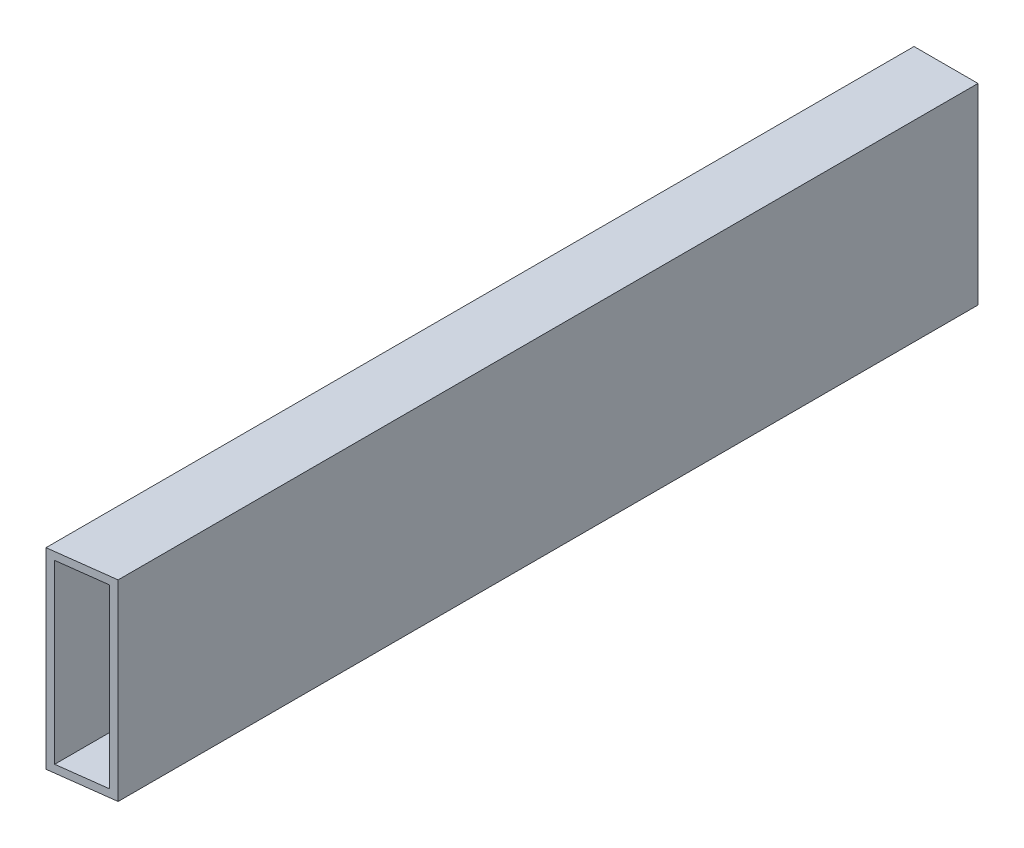
ISO-10303-21;
HEADER;
FILE_DESCRIPTION(('STEP AP214'),'2;1');
FILE_NAME('part.step','',(''),(''),'','','');
FILE_SCHEMA(('AUTOMOTIVE_DESIGN { 1 0 10303 214 1 1 1 1 }'));
ENDSEC;
DATA;
#1=APPLICATION_CONTEXT('core data for automotive mechanical design processes');
#2=APPLICATION_PROTOCOL_DEFINITION('international standard','automotive_design',2000,#1);
#3=PRODUCT_CONTEXT('',#1,'mechanical');
#4=PRODUCT('Part','Part','',(#3));
#5=PRODUCT_RELATED_PRODUCT_CATEGORY('part','',(#4));
#6=PRODUCT_DEFINITION_FORMATION('','',#4);
#7=PRODUCT_DEFINITION_CONTEXT('part definition',#1,'design');
#8=PRODUCT_DEFINITION('design','',#6,#7);
#9=PRODUCT_DEFINITION_SHAPE('','',#8);
#10=(LENGTH_UNIT() NAMED_UNIT(*) SI_UNIT(.MILLI.,.METRE.));
#11=(NAMED_UNIT(*) PLANE_ANGLE_UNIT() SI_UNIT($,.RADIAN.));
#12=(NAMED_UNIT(*) SI_UNIT($,.STERADIAN.) SOLID_ANGLE_UNIT());
#13=UNCERTAINTY_MEASURE_WITH_UNIT(LENGTH_MEASURE(1.E-05),#10,'distance_accuracy_value','');
#14=(GEOMETRIC_REPRESENTATION_CONTEXT(3) GLOBAL_UNCERTAINTY_ASSIGNED_CONTEXT((#13)) GLOBAL_UNIT_ASSIGNED_CONTEXT((#10,
#11,#12)) REPRESENTATION_CONTEXT('',''));
#15=CARTESIAN_POINT('',(0.,0.,0.));
#16=DIRECTION('',(0.,0.,1.));
#17=DIRECTION('',(1.,0.,0.));
#18=AXIS2_PLACEMENT_3D('',#15,#16,#17);
#19=CARTESIAN_POINT('',(12.7000000000001,0.,343.));
#20=DIRECTION('',(-1.,0.,0.));
#21=DIRECTION('',(0.,-1.,0.));
#22=AXIS2_PLACEMENT_3D('',#19,#20,#21);
#23=PLANE('',#22);
#24=DIRECTION('',(0.,0.,-1.));
#25=VECTOR('',#24,1.);
#26=CARTESIAN_POINT('',(12.7,38.1,343.));
#27=LINE('',#26,#25);
#28=CARTESIAN_POINT('',(12.7,38.1,341.382355489375));
#29=VERTEX_POINT('',#28);
#30=CARTESIAN_POINT('',(12.7,38.1,0.));
#31=VERTEX_POINT('',#30);
#32=EDGE_CURVE('E11',#29,#31,#27,.T.);
#33=ORIENTED_EDGE('',*,*,#32,.F.);
#34=DIRECTION('',(0.,-1.,0.));
#35=VECTOR('',#34,1.);
#36=CARTESIAN_POINT('',(12.7000000000001,0.,341.382355489375));
#37=LINE('',#36,#35);
#38=CARTESIAN_POINT('',(12.7,-38.1,341.382355489375));
#39=VERTEX_POINT('',#38);
#40=EDGE_CURVE('E100',#29,#39,#37,.T.);
#41=ORIENTED_EDGE('',*,*,#40,.T.);
#42=DIRECTION('',(0.,0.,-1.));
#43=VECTOR('',#42,1.);
#44=CARTESIAN_POINT('',(12.7,-38.1,343.));
#45=LINE('',#44,#43);
#46=CARTESIAN_POINT('',(12.7,-38.1,0.));
#47=VERTEX_POINT('',#46);
#48=EDGE_CURVE('E110',#39,#47,#45,.T.);
#49=ORIENTED_EDGE('',*,*,#48,.T.);
#50=DIRECTION('',(0.,1.,0.));
#51=VECTOR('',#50,1.);
#52=CARTESIAN_POINT('',(12.7000000000001,0.,0.));
#53=LINE('',#52,#51);
#54=EDGE_CURVE('E154',#47,#31,#53,.T.);
#55=ORIENTED_EDGE('',*,*,#54,.T.);
#56=EDGE_LOOP('',(#33,#41,#49,#55));
#57=FACE_BOUND('',#56,.T.);
#58=ADVANCED_FACE('F34',(#57),#23,.F.);
#59=CARTESIAN_POINT('',(0.,38.1,343.));
#60=DIRECTION('',(0.,1.,0.));
#61=DIRECTION('',(0.,0.,1.));
#62=AXIS2_PLACEMENT_3D('',#59,#60,#61);
#63=PLANE('',#62);
#64=DIRECTION('',(-0.991985376438617,0.,0.126352732190229));
#65=VECTOR('',#64,1.);
#66=CARTESIAN_POINT('',(0.,38.1,343.));
#67=LINE('',#66,#65);
#68=CARTESIAN_POINT('',(-12.7,38.1,344.617644510625));
#69=VERTEX_POINT('',#68);
#70=EDGE_CURVE('E113',#29,#69,#67,.T.);
#71=ORIENTED_EDGE('',*,*,#70,.F.);
#72=ORIENTED_EDGE('',*,*,#32,.T.);
#73=DIRECTION('',(1.,0.,0.));
#74=VECTOR('',#73,1.);
#75=CARTESIAN_POINT('',(0.,38.1,0.));
#76=LINE('',#75,#74);
#77=CARTESIAN_POINT('',(-12.7,38.1,0.));
#78=VERTEX_POINT('',#77);
#79=EDGE_CURVE('E159',#78,#31,#76,.T.);
#80=ORIENTED_EDGE('',*,*,#79,.F.);
#81=DIRECTION('',(0.,0.,-1.));
#82=VECTOR('',#81,1.);
#83=CARTESIAN_POINT('',(-12.7,38.1,343.));
#84=LINE('',#83,#82);
#85=EDGE_CURVE('E43',#69,#78,#84,.T.);
#86=ORIENTED_EDGE('',*,*,#85,.F.);
#87=EDGE_LOOP('',(#71,#72,#80,#86));
#88=FACE_BOUND('',#87,.T.);
#89=ADVANCED_FACE('F167',(#88),#63,.T.);
#90=CARTESIAN_POINT('',(-12.7,0.,343.));
#91=DIRECTION('',(-1.,0.,0.));
#92=DIRECTION('',(0.,0.,1.));
#93=AXIS2_PLACEMENT_3D('',#90,#91,#92);
#94=PLANE('',#93);
#95=DIRECTION('',(0.,-1.,0.));
#96=VECTOR('',#95,1.);
#97=CARTESIAN_POINT('',(-12.7,0.,344.617644510625));
#98=LINE('',#97,#96);
#99=CARTESIAN_POINT('',(-12.7,-38.1,344.617644510625));
#100=VERTEX_POINT('',#99);
#101=EDGE_CURVE('E59',#69,#100,#98,.T.);
#102=ORIENTED_EDGE('',*,*,#101,.F.);
#103=ORIENTED_EDGE('',*,*,#85,.T.);
#104=DIRECTION('',(0.,1.,0.));
#105=VECTOR('',#104,1.);
#106=CARTESIAN_POINT('',(-12.7,0.,0.));
#107=LINE('',#106,#105);
#108=CARTESIAN_POINT('',(-12.7,-38.1,0.));
#109=VERTEX_POINT('',#108);
#110=EDGE_CURVE('E161',#109,#78,#107,.T.);
#111=ORIENTED_EDGE('',*,*,#110,.F.);
#112=DIRECTION('',(0.,0.,-1.));
#113=VECTOR('',#112,1.);
#114=CARTESIAN_POINT('',(-12.7,-38.1,343.));
#115=LINE('',#114,#113);
#116=EDGE_CURVE('E119',#100,#109,#115,.T.);
#117=ORIENTED_EDGE('',*,*,#116,.F.);
#118=EDGE_LOOP('',(#102,#103,#111,#117));
#119=FACE_BOUND('',#118,.T.);
#120=ADVANCED_FACE('F192',(#119),#94,.T.);
#121=CARTESIAN_POINT('',(9.652,0.,343.));
#122=DIRECTION('',(1.,0.,0.));
#123=DIRECTION('',(0.,1.,0.));
#124=AXIS2_PLACEMENT_3D('',#121,#122,#123);
#125=PLANE('',#124);
#126=DIRECTION('',(0.,0.,-1.));
#127=VECTOR('',#126,1.);
#128=CARTESIAN_POINT('',(9.652,-35.052,343.));
#129=LINE('',#128,#127);
#130=CARTESIAN_POINT('',(9.652,-35.052,341.770590171925));
#131=VERTEX_POINT('',#130);
#132=CARTESIAN_POINT('',(9.652,-35.052,0.));
#133=VERTEX_POINT('',#132);
#134=EDGE_CURVE('E38',#131,#133,#129,.T.);
#135=ORIENTED_EDGE('',*,*,#134,.F.);
#136=DIRECTION('',(0.,1.,0.));
#137=VECTOR('',#136,1.);
#138=CARTESIAN_POINT('',(9.652,0.,341.770590171925));
#139=LINE('',#138,#137);
#140=CARTESIAN_POINT('',(9.652,35.052,341.770590171925));
#141=VERTEX_POINT('',#140);
#142=EDGE_CURVE('E169',#131,#141,#139,.T.);
#143=ORIENTED_EDGE('',*,*,#142,.T.);
#144=DIRECTION('',(0.,0.,-1.));
#145=VECTOR('',#144,1.);
#146=CARTESIAN_POINT('',(9.65199999999999,35.052,343.));
#147=LINE('',#146,#145);
#148=CARTESIAN_POINT('',(9.65199999999999,35.052,0.));
#149=VERTEX_POINT('',#148);
#150=EDGE_CURVE('E127',#141,#149,#147,.T.);
#151=ORIENTED_EDGE('',*,*,#150,.T.);
#152=DIRECTION('',(0.,-1.,0.));
#153=VECTOR('',#152,1.);
#154=CARTESIAN_POINT('',(9.652,0.,0.));
#155=LINE('',#154,#153);
#156=EDGE_CURVE('E112',#149,#133,#155,.T.);
#157=ORIENTED_EDGE('',*,*,#156,.T.);
#158=EDGE_LOOP('',(#135,#143,#151,#157));
#159=FACE_BOUND('',#158,.T.);
#160=ADVANCED_FACE('F36',(#159),#125,.F.);
#161=CARTESIAN_POINT('',(0.,-35.052,343.));
#162=DIRECTION('',(0.,1.,0.));
#163=DIRECTION('',(-1.,0.,0.));
#164=AXIS2_PLACEMENT_3D('',#161,#162,#163);
#165=PLANE('',#164);
#166=DIRECTION('',(-0.991985376438617,0.,0.126352732190229));
#167=VECTOR('',#166,1.);
#168=CARTESIAN_POINT('',(0.,-35.052,343.));
#169=LINE('',#168,#167);
#170=CARTESIAN_POINT('',(-9.65199999999999,-35.052,344.229409828075));
#171=VERTEX_POINT('',#170);
#172=EDGE_CURVE('E178',#131,#171,#169,.T.);
#173=ORIENTED_EDGE('',*,*,#172,.F.);
#174=ORIENTED_EDGE('',*,*,#134,.T.);
#175=DIRECTION('',(1.,0.,0.));
#176=VECTOR('',#175,1.);
#177=CARTESIAN_POINT('',(0.,-35.052,0.));
#178=LINE('',#177,#176);
#179=CARTESIAN_POINT('',(-9.65199999999999,-35.052,0.));
#180=VERTEX_POINT('',#179);
#181=EDGE_CURVE('E141',#180,#133,#178,.T.);
#182=ORIENTED_EDGE('',*,*,#181,.F.);
#183=DIRECTION('',(0.,0.,-1.));
#184=VECTOR('',#183,1.);
#185=CARTESIAN_POINT('',(-9.65199999999999,-35.052,343.));
#186=LINE('',#185,#184);
#187=EDGE_CURVE('E122',#171,#180,#186,.T.);
#188=ORIENTED_EDGE('',*,*,#187,.F.);
#189=EDGE_LOOP('',(#173,#174,#182,#188));
#190=FACE_BOUND('',#189,.T.);
#191=ADVANCED_FACE('F142',(#190),#165,.T.);
#192=CARTESIAN_POINT('',(-9.65199999999999,0.,343.));
#193=DIRECTION('',(1.,0.,0.));
#194=DIRECTION('',(0.,1.,0.));
#195=AXIS2_PLACEMENT_3D('',#192,#193,#194);
#196=PLANE('',#195);
#197=DIRECTION('',(0.,1.,0.));
#198=VECTOR('',#197,1.);
#199=CARTESIAN_POINT('',(-9.65199999999999,0.,344.229409828075));
#200=LINE('',#199,#198);
#201=CARTESIAN_POINT('',(-9.652,35.052,344.229409828075));
#202=VERTEX_POINT('',#201);
#203=EDGE_CURVE('E51',#171,#202,#200,.T.);
#204=ORIENTED_EDGE('',*,*,#203,.F.);
#205=ORIENTED_EDGE('',*,*,#187,.T.);
#206=DIRECTION('',(0.,-1.,0.));
#207=VECTOR('',#206,1.);
#208=CARTESIAN_POINT('',(-9.65199999999999,0.,0.));
#209=LINE('',#208,#207);
#210=CARTESIAN_POINT('',(-9.65199999999999,35.052,0.));
#211=VERTEX_POINT('',#210);
#212=EDGE_CURVE('E137',#211,#180,#209,.T.);
#213=ORIENTED_EDGE('',*,*,#212,.F.);
#214=DIRECTION('',(0.,0.,-1.));
#215=VECTOR('',#214,1.);
#216=CARTESIAN_POINT('',(-9.65199999999999,35.052,343.));
#217=LINE('',#216,#215);
#218=EDGE_CURVE('E129',#202,#211,#217,.T.);
#219=ORIENTED_EDGE('',*,*,#218,.F.);
#220=EDGE_LOOP('',(#204,#205,#213,#219));
#221=FACE_BOUND('',#220,.T.);
#222=ADVANCED_FACE('F134',(#221),#196,.T.);
#223=CARTESIAN_POINT('',(0.,35.052,343.));
#224=DIRECTION('',(0.,1.,0.));
#225=DIRECTION('',(0.,0.,1.));
#226=AXIS2_PLACEMENT_3D('',#223,#224,#225);
#227=PLANE('',#226);
#228=ORIENTED_EDGE('',*,*,#150,.F.);
#229=DIRECTION('',(-0.991985376438617,0.,0.126352732190229));
#230=VECTOR('',#229,1.);
#231=CARTESIAN_POINT('',(0.,35.052,343.));
#232=LINE('',#231,#230);
#233=EDGE_CURVE('E105',#141,#202,#232,.T.);
#234=ORIENTED_EDGE('',*,*,#233,.T.);
#235=ORIENTED_EDGE('',*,*,#218,.T.);
#236=DIRECTION('',(1.,0.,0.));
#237=VECTOR('',#236,1.);
#238=CARTESIAN_POINT('',(0.,35.052,0.));
#239=LINE('',#238,#237);
#240=EDGE_CURVE('E152',#211,#149,#239,.T.);
#241=ORIENTED_EDGE('',*,*,#240,.T.);
#242=EDGE_LOOP('',(#228,#234,#235,#241));
#243=FACE_BOUND('',#242,.T.);
#244=ADVANCED_FACE('F176',(#243),#227,.F.);
#245=CARTESIAN_POINT('',(0.,-38.1,343.));
#246=DIRECTION('',(0.,-1.,0.));
#247=DIRECTION('',(0.,0.,-1.));
#248=AXIS2_PLACEMENT_3D('',#245,#246,#247);
#249=PLANE('',#248);
#250=DIRECTION('',(-0.991985376438617,0.,0.126352732190229));
#251=VECTOR('',#250,1.);
#252=CARTESIAN_POINT('',(42.9916414737799,-38.1,337.524000564346));
#253=LINE('',#252,#251);
#254=EDGE_CURVE('E97',#39,#100,#253,.T.);
#255=ORIENTED_EDGE('',*,*,#254,.T.);
#256=ORIENTED_EDGE('',*,*,#116,.T.);
#257=DIRECTION('',(-1.,0.,0.));
#258=VECTOR('',#257,1.);
#259=CARTESIAN_POINT('',(0.,-38.1,0.));
#260=LINE('',#259,#258);
#261=EDGE_CURVE('E118',#47,#109,#260,.T.);
#262=ORIENTED_EDGE('',*,*,#261,.F.);
#263=ORIENTED_EDGE('',*,*,#48,.F.);
#264=EDGE_LOOP('',(#255,#256,#262,#263));
#265=FACE_BOUND('',#264,.T.);
#266=ADVANCED_FACE('F116',(#265),#249,.T.);
#267=CARTESIAN_POINT('',(0.,0.,0.));
#268=DIRECTION('',(0.,0.,1.));
#269=DIRECTION('',(1.,0.,0.));
#270=AXIS2_PLACEMENT_3D('',#267,#268,#269);
#271=PLANE('',#270);
#272=ORIENTED_EDGE('',*,*,#156,.F.);
#273=ORIENTED_EDGE('',*,*,#240,.F.);
#274=ORIENTED_EDGE('',*,*,#212,.T.);
#275=ORIENTED_EDGE('',*,*,#181,.T.);
#276=EDGE_LOOP('',(#272,#273,#274,#275));
#277=FACE_BOUND('',#276,.T.);
#278=ORIENTED_EDGE('',*,*,#54,.F.);
#279=ORIENTED_EDGE('',*,*,#261,.T.);
#280=ORIENTED_EDGE('',*,*,#110,.T.);
#281=ORIENTED_EDGE('',*,*,#79,.T.);
#282=EDGE_LOOP('',(#278,#279,#280,#281));
#283=FACE_BOUND('',#282,.T.);
#284=ADVANCED_FACE('F149',(#277,#283),#271,.F.);
#285=CARTESIAN_POINT('',(42.9916414737799,-38.1,337.524000564346));
#286=DIRECTION('',(-0.126352732190229,0.,-0.991985376438617));
#287=DIRECTION('',(-0.991985376438617,0.,0.126352732190229));
#288=AXIS2_PLACEMENT_3D('',#285,#286,#287);
#289=PLANE('',#288);
#290=ORIENTED_EDGE('',*,*,#172,.T.);
#291=ORIENTED_EDGE('',*,*,#203,.T.);
#292=ORIENTED_EDGE('',*,*,#233,.F.);
#293=ORIENTED_EDGE('',*,*,#142,.F.);
#294=EDGE_LOOP('',(#290,#291,#292,#293));
#295=FACE_BOUND('',#294,.T.);
#296=ORIENTED_EDGE('',*,*,#70,.T.);
#297=ORIENTED_EDGE('',*,*,#101,.T.);
#298=ORIENTED_EDGE('',*,*,#254,.F.);
#299=ORIENTED_EDGE('',*,*,#40,.F.);
#300=EDGE_LOOP('',(#296,#297,#298,#299));
#301=FACE_BOUND('',#300,.T.);
#302=ADVANCED_FACE('F99',(#295,#301),#289,.F.);
#303=CLOSED_SHELL('',(#58,#89,#120,#160,#191,#222,#244,#266,#284,#302));
#304=MANIFOLD_SOLID_BREP('B2',#303);
#305=ADVANCED_BREP_SHAPE_REPRESENTATION('',(#18,#304),#14);
#306=SHAPE_DEFINITION_REPRESENTATION(#9,#305);
ENDSEC;
END-ISO-10303-21;
